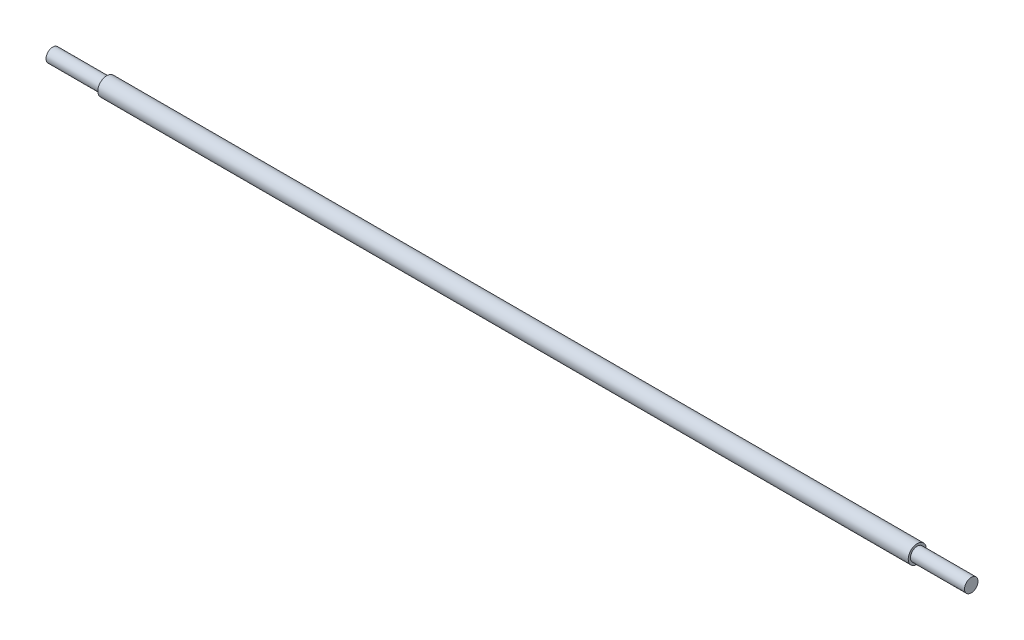
ISO-10303-21;
HEADER;
FILE_DESCRIPTION(('STEP AP214'),'2;1');
FILE_NAME('part.step','',(''),(''),'','','');
FILE_SCHEMA(('AUTOMOTIVE_DESIGN { 1 0 10303 214 1 1 1 1 }'));
ENDSEC;
DATA;
#1=APPLICATION_CONTEXT('core data for automotive mechanical design processes');
#2=APPLICATION_PROTOCOL_DEFINITION('international standard','automotive_design',2000,#1);
#3=PRODUCT_CONTEXT('',#1,'mechanical');
#4=PRODUCT('Part','Part','',(#3));
#5=PRODUCT_RELATED_PRODUCT_CATEGORY('part','',(#4));
#6=PRODUCT_DEFINITION_FORMATION('','',#4);
#7=PRODUCT_DEFINITION_CONTEXT('part definition',#1,'design');
#8=PRODUCT_DEFINITION('design','',#6,#7);
#9=PRODUCT_DEFINITION_SHAPE('','',#8);
#10=(LENGTH_UNIT() NAMED_UNIT(*) SI_UNIT(.MILLI.,.METRE.));
#11=(NAMED_UNIT(*) PLANE_ANGLE_UNIT() SI_UNIT($,.RADIAN.));
#12=(NAMED_UNIT(*) SI_UNIT($,.STERADIAN.) SOLID_ANGLE_UNIT());
#13=UNCERTAINTY_MEASURE_WITH_UNIT(LENGTH_MEASURE(1.E-05),#10,'distance_accuracy_value','');
#14=(GEOMETRIC_REPRESENTATION_CONTEXT(3) GLOBAL_UNCERTAINTY_ASSIGNED_CONTEXT((#13)) GLOBAL_UNIT_ASSIGNED_CONTEXT((#10,
#11,#12)) REPRESENTATION_CONTEXT('',''));
#15=CARTESIAN_POINT('',(0.,0.,0.));
#16=DIRECTION('',(0.,0.,1.));
#17=DIRECTION('',(1.,0.,0.));
#18=AXIS2_PLACEMENT_3D('',#15,#16,#17);
#19=CARTESIAN_POINT('',(-571.5,0.,-9.525));
#20=DIRECTION('',(1.,0.,0.));
#21=DIRECTION('',(0.,0.,-1.));
#22=AXIS2_PLACEMENT_3D('',#19,#20,#21);
#23=PLANE('',#22);
#24=CARTESIAN_POINT('',(-571.5,0.,0.));
#25=DIRECTION('',(-1.,0.,0.));
#26=DIRECTION('',(0.,0.,1.));
#27=AXIS2_PLACEMENT_3D('',#24,#25,#26);
#28=CIRCLE('',#27,9.52499999999999);
#29=CARTESIAN_POINT('',(-571.5,0.,9.52499999999998));
#30=VERTEX_POINT('',#29);
#31=EDGE_CURVE('E57',#30,#30,#28,.T.);
#32=ORIENTED_EDGE('',*,*,#31,.F.);
#33=EDGE_LOOP('',(#32));
#34=FACE_BOUND('',#33,.T.);
#35=CARTESIAN_POINT('',(-571.5,0.,0.));
#36=DIRECTION('',(-1.,0.,0.));
#37=DIRECTION('',(0.,0.,1.));
#38=AXIS2_PLACEMENT_3D('',#35,#36,#37);
#39=CIRCLE('',#38,12.7);
#40=CARTESIAN_POINT('',(-571.5,0.,12.7));
#41=VERTEX_POINT('',#40);
#42=EDGE_CURVE('E10',#41,#41,#39,.T.);
#43=ORIENTED_EDGE('',*,*,#42,.T.);
#44=EDGE_LOOP('',(#43));
#45=FACE_BOUND('',#44,.T.);
#46=ADVANCED_FACE('F35',(#34,#45),#23,.F.);
#47=CARTESIAN_POINT('',(-647.7,0.,0.));
#48=DIRECTION('',(-1.,0.,0.));
#49=DIRECTION('',(0.,0.,1.));
#50=AXIS2_PLACEMENT_3D('',#47,#48,#49);
#51=CYLINDRICAL_SURFACE('',#50,12.7);
#52=ORIENTED_EDGE('',*,*,#42,.F.);
#53=EDGE_LOOP('',(#52));
#54=FACE_BOUND('',#53,.T.);
#55=CARTESIAN_POINT('',(571.5,0.,-1.49308937752045E-13));
#56=DIRECTION('',(-1.,0.,0.));
#57=DIRECTION('',(0.,0.,1.));
#58=AXIS2_PLACEMENT_3D('',#55,#56,#57);
#59=CIRCLE('',#58,12.7);
#60=CARTESIAN_POINT('',(571.5,0.,12.6999999999998));
#61=VERTEX_POINT('',#60);
#62=EDGE_CURVE('E41',#61,#61,#59,.T.);
#63=ORIENTED_EDGE('',*,*,#62,.T.);
#64=EDGE_LOOP('',(#63));
#65=FACE_BOUND('',#64,.T.);
#66=ADVANCED_FACE('F64',(#54,#65),#51,.T.);
#67=CARTESIAN_POINT('',(571.5,0.,-9.52500000000014));
#68=DIRECTION('',(-1.,0.,0.));
#69=DIRECTION('',(0.,0.,1.));
#70=AXIS2_PLACEMENT_3D('',#67,#68,#69);
#71=PLANE('',#70);
#72=ORIENTED_EDGE('',*,*,#62,.F.);
#73=EDGE_LOOP('',(#72));
#74=FACE_BOUND('',#73,.T.);
#75=CARTESIAN_POINT('',(571.5,0.,-1.49308937752045E-13));
#76=DIRECTION('',(-1.,0.,0.));
#77=DIRECTION('',(0.,0.,1.));
#78=AXIS2_PLACEMENT_3D('',#75,#76,#77);
#79=CIRCLE('',#78,9.52499999999999);
#80=CARTESIAN_POINT('',(571.5,0.,9.52499999999984));
#81=VERTEX_POINT('',#80);
#82=EDGE_CURVE('E45',#81,#81,#79,.T.);
#83=ORIENTED_EDGE('',*,*,#82,.T.);
#84=EDGE_LOOP('',(#83));
#85=FACE_BOUND('',#84,.T.);
#86=ADVANCED_FACE('F68',(#74,#85),#71,.F.);
#87=CARTESIAN_POINT('',(-647.7,0.,0.));
#88=DIRECTION('',(-1.,0.,0.));
#89=DIRECTION('',(0.,0.,1.));
#90=AXIS2_PLACEMENT_3D('',#87,#88,#89);
#91=CYLINDRICAL_SURFACE('',#90,9.525);
#92=ORIENTED_EDGE('',*,*,#82,.F.);
#93=EDGE_LOOP('',(#92));
#94=FACE_BOUND('',#93,.T.);
#95=CARTESIAN_POINT('',(647.7,0.,-1.58640746361548E-13));
#96=DIRECTION('',(-1.,0.,0.));
#97=DIRECTION('',(0.,0.,1.));
#98=AXIS2_PLACEMENT_3D('',#95,#96,#97);
#99=CIRCLE('',#98,9.525);
#100=CARTESIAN_POINT('',(647.7,0.,9.52499999999984));
#101=VERTEX_POINT('',#100);
#102=EDGE_CURVE('E49',#101,#101,#99,.T.);
#103=ORIENTED_EDGE('',*,*,#102,.T.);
#104=EDGE_LOOP('',(#103));
#105=FACE_BOUND('',#104,.T.);
#106=ADVANCED_FACE('F73',(#94,#105),#91,.T.);
#107=CARTESIAN_POINT('',(647.7,0.,-1.58640746361548E-13));
#108=DIRECTION('',(-1.,0.,0.));
#109=DIRECTION('',(0.,0.,1.));
#110=AXIS2_PLACEMENT_3D('',#107,#108,#109);
#111=PLANE('',#110);
#112=ORIENTED_EDGE('',*,*,#102,.F.);
#113=EDGE_LOOP('',(#112));
#114=FACE_BOUND('',#113,.T.);
#115=ADVANCED_FACE('F79',(#114),#111,.F.);
#116=CARTESIAN_POINT('',(-647.7,0.,0.));
#117=DIRECTION('',(1.,0.,0.));
#118=DIRECTION('',(0.,0.,-1.));
#119=AXIS2_PLACEMENT_3D('',#116,#117,#118);
#120=PLANE('',#119);
#121=CARTESIAN_POINT('',(-647.7,0.,0.));
#122=DIRECTION('',(-1.,0.,0.));
#123=DIRECTION('',(0.,0.,1.));
#124=AXIS2_PLACEMENT_3D('',#121,#122,#123);
#125=CIRCLE('',#124,9.525);
#126=CARTESIAN_POINT('',(-647.7,0.,9.525));
#127=VERTEX_POINT('',#126);
#128=EDGE_CURVE('E54',#127,#127,#125,.T.);
#129=ORIENTED_EDGE('',*,*,#128,.T.);
#130=EDGE_LOOP('',(#129));
#131=FACE_BOUND('',#130,.T.);
#132=ADVANCED_FACE('F83',(#131),#120,.F.);
#133=CARTESIAN_POINT('',(-647.7,0.,0.));
#134=DIRECTION('',(-1.,0.,0.));
#135=DIRECTION('',(0.,0.,1.));
#136=AXIS2_PLACEMENT_3D('',#133,#134,#135);
#137=CYLINDRICAL_SURFACE('',#136,9.525);
#138=ORIENTED_EDGE('',*,*,#128,.F.);
#139=EDGE_LOOP('',(#138));
#140=FACE_BOUND('',#139,.T.);
#141=ORIENTED_EDGE('',*,*,#31,.T.);
#142=EDGE_LOOP('',(#141));
#143=FACE_BOUND('',#142,.T.);
#144=ADVANCED_FACE('F61',(#140,#143),#137,.T.);
#145=CLOSED_SHELL('',(#46,#66,#86,#106,#115,#132,#144));
#146=MANIFOLD_SOLID_BREP('B2',#145);
#147=ADVANCED_BREP_SHAPE_REPRESENTATION('',(#18,#146),#14);
#148=SHAPE_DEFINITION_REPRESENTATION(#9,#147);
ENDSEC;
END-ISO-10303-21;
